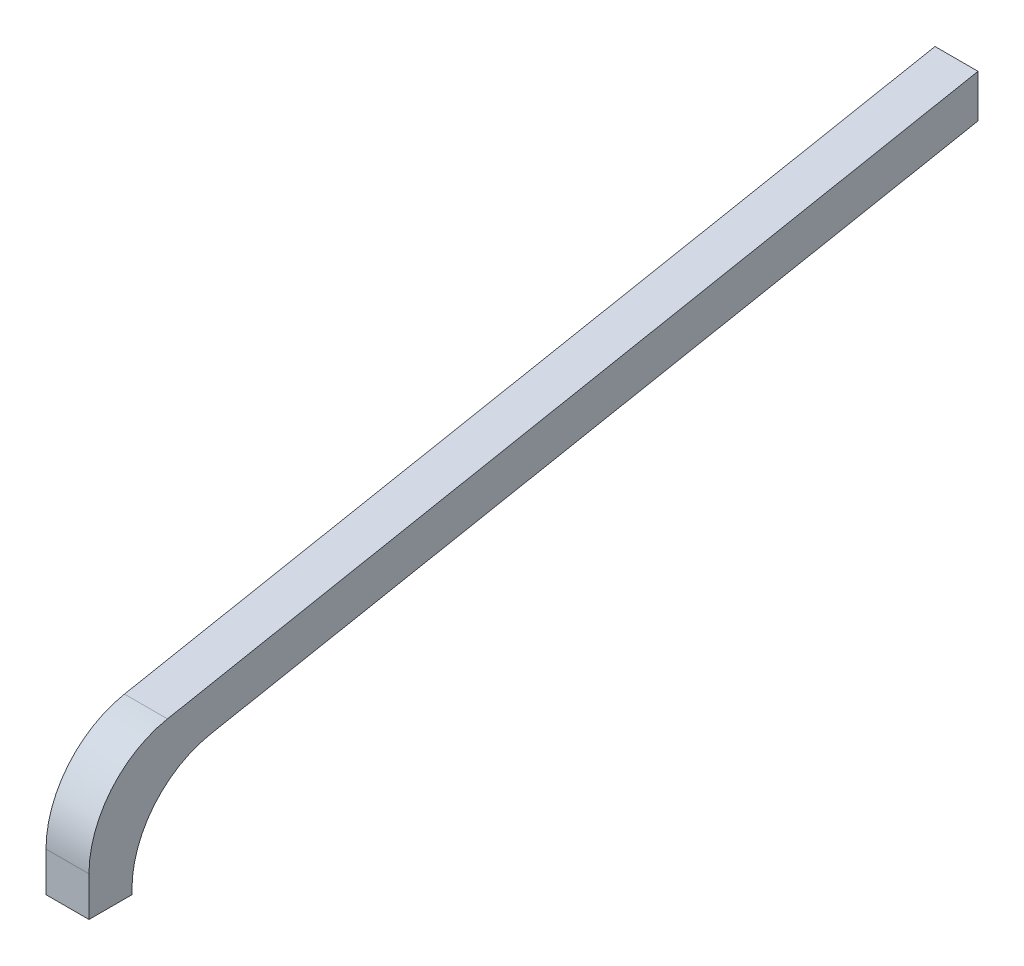
ISO-10303-21;
HEADER;
FILE_DESCRIPTION(('STEP AP214'),'2;1');
FILE_NAME('part.step','',(''),(''),'','','');
FILE_SCHEMA(('AUTOMOTIVE_DESIGN { 1 0 10303 214 1 1 1 1 }'));
ENDSEC;
DATA;
#1=APPLICATION_CONTEXT('core data for automotive mechanical design processes');
#2=APPLICATION_PROTOCOL_DEFINITION('international standard','automotive_design',2000,#1);
#3=PRODUCT_CONTEXT('',#1,'mechanical');
#4=PRODUCT('Part','Part','',(#3));
#5=PRODUCT_RELATED_PRODUCT_CATEGORY('part','',(#4));
#6=PRODUCT_DEFINITION_FORMATION('','',#4);
#7=PRODUCT_DEFINITION_CONTEXT('part definition',#1,'design');
#8=PRODUCT_DEFINITION('design','',#6,#7);
#9=PRODUCT_DEFINITION_SHAPE('','',#8);
#10=(LENGTH_UNIT() NAMED_UNIT(*) SI_UNIT(.MILLI.,.METRE.));
#11=(NAMED_UNIT(*) PLANE_ANGLE_UNIT() SI_UNIT($,.RADIAN.));
#12=(NAMED_UNIT(*) SI_UNIT($,.STERADIAN.) SOLID_ANGLE_UNIT());
#13=UNCERTAINTY_MEASURE_WITH_UNIT(LENGTH_MEASURE(1.E-05),#10,'distance_accuracy_value','');
#14=(GEOMETRIC_REPRESENTATION_CONTEXT(3) GLOBAL_UNCERTAINTY_ASSIGNED_CONTEXT((#13)) GLOBAL_UNIT_ASSIGNED_CONTEXT((#10,
#11,#12)) REPRESENTATION_CONTEXT('',''));
#15=CARTESIAN_POINT('',(0.,0.,0.));
#16=DIRECTION('',(0.,0.,1.));
#17=DIRECTION('',(1.,0.,0.));
#18=AXIS2_PLACEMENT_3D('',#15,#16,#17);
#19=CARTESIAN_POINT('',(-0.73025,-3.01580115473571,-2.8055));
#20=DIRECTION('',(1.,0.,0.));
#21=DIRECTION('',(0.,0.,-1.));
#22=AXIS2_PLACEMENT_3D('',#19,#20,#21);
#23=PLANE('',#22);
#24=DIRECTION('',(0.,-0.18846469104419,0.982079966311104));
#25=VECTOR('',#24,1.);
#26=CARTESIAN_POINT('',(-0.73025,-2.3929200336889,-3.06153530895581));
#27=LINE('',#26,#25);
#28=CARTESIAN_POINT('',(-0.73025,-0.869500000000001,-11.));
#29=VERTEX_POINT('',#28);
#30=CARTESIAN_POINT('',(-0.73025,-2.3929200336889,-3.06153530895581));
#31=VERTEX_POINT('',#30);
#32=EDGE_CURVE('E96',#29,#31,#27,.T.);
#33=ORIENTED_EDGE('',*,*,#32,.T.);
#34=CARTESIAN_POINT('',(-0.73025,-3.375,-3.25));
#35=DIRECTION('',(-1.,0.,0.));
#36=DIRECTION('',(0.,0.,1.));
#37=AXIS2_PLACEMENT_3D('',#34,#35,#36);
#38=CIRCLE('',#37,1.);
#39=CARTESIAN_POINT('',(-0.73025,-3.375,-2.25));
#40=VERTEX_POINT('',#39);
#41=EDGE_CURVE('E119',#31,#40,#38,.F.);
#42=ORIENTED_EDGE('',*,*,#41,.T.);
#43=DIRECTION('',(0.,1.,0.));
#44=VECTOR('',#43,1.);
#45=CARTESIAN_POINT('',(-0.73025,-3.425,-2.25));
#46=LINE('',#45,#44);
#47=CARTESIAN_POINT('',(-0.73025,-3.425,-2.25));
#48=VERTEX_POINT('',#47);
#49=EDGE_CURVE('E124',#40,#48,#46,.F.);
#50=ORIENTED_EDGE('',*,*,#49,.T.);
#51=DIRECTION('',(0.,0.,1.));
#52=VECTOR('',#51,1.);
#53=CARTESIAN_POINT('',(-0.73025,-3.425,-1.8055));
#54=LINE('',#53,#52);
#55=CARTESIAN_POINT('',(-0.73025,-3.425,-1.8055));
#56=VERTEX_POINT('',#55);
#57=EDGE_CURVE('E133',#48,#56,#54,.T.);
#58=ORIENTED_EDGE('',*,*,#57,.T.);
#59=DIRECTION('',(0.,1.,0.));
#60=VECTOR('',#59,1.);
#61=CARTESIAN_POINT('',(-0.73025,-3.01580115473571,-1.8055));
#62=LINE('',#61,#60);
#63=CARTESIAN_POINT('',(-0.73025,-3.01580115473571,-1.8055));
#64=VERTEX_POINT('',#63);
#65=EDGE_CURVE('E141',#56,#64,#62,.T.);
#66=ORIENTED_EDGE('',*,*,#65,.T.);
#67=CARTESIAN_POINT('',(-0.73025,-3.01580115473571,-2.8055));
#68=DIRECTION('',(-1.,0.,0.));
#69=DIRECTION('',(0.,0.,1.));
#70=AXIS2_PLACEMENT_3D('',#67,#68,#69);
#71=CIRCLE('',#70,1.);
#72=CARTESIAN_POINT('',(-0.73025,-2.03372118842461,-2.61703530895581));
#73=VERTEX_POINT('',#72);
#74=EDGE_CURVE('E20',#73,#64,#71,.F.);
#75=ORIENTED_EDGE('',*,*,#74,.F.);
#76=DIRECTION('',(0.,0.18846469104419,-0.982079966311104));
#77=VECTOR('',#76,1.);
#78=CARTESIAN_POINT('',(-0.73025,-0.425000000000001,-11.));
#79=LINE('',#78,#77);
#80=CARTESIAN_POINT('',(-0.73025,-0.425000000000001,-11.));
#81=VERTEX_POINT('',#80);
#82=EDGE_CURVE('E150',#73,#81,#79,.T.);
#83=ORIENTED_EDGE('',*,*,#82,.T.);
#84=DIRECTION('',(0.,1.,0.));
#85=VECTOR('',#84,1.);
#86=CARTESIAN_POINT('',(-0.73025,-0.869500000000001,-11.));
#87=LINE('',#86,#85);
#88=EDGE_CURVE('E70',#81,#29,#87,.F.);
#89=ORIENTED_EDGE('',*,*,#88,.T.);
#90=EDGE_LOOP('',(#33,#42,#50,#58,#66,#75,#83,#89));
#91=FACE_BOUND('',#90,.T.);
#92=ADVANCED_FACE('F17',(#91),#23,.F.);
#93=CARTESIAN_POINT('',(-0.28575,-0.869500000000001,-11.));
#94=DIRECTION('',(0.,0.,1.));
#95=DIRECTION('',(1.,0.,0.));
#96=AXIS2_PLACEMENT_3D('',#93,#94,#95);
#97=PLANE('',#96);
#98=DIRECTION('',(1.,0.,0.));
#99=VECTOR('',#98,1.);
#100=CARTESIAN_POINT('',(-0.28575,-0.425000000000001,-11.));
#101=LINE('',#100,#99);
#102=CARTESIAN_POINT('',(-0.28575,-0.425000000000001,-11.));
#103=VERTEX_POINT('',#102);
#104=EDGE_CURVE('E91',#81,#103,#101,.T.);
#105=ORIENTED_EDGE('',*,*,#104,.T.);
#106=DIRECTION('',(0.,1.,0.));
#107=VECTOR('',#106,1.);
#108=CARTESIAN_POINT('',(-0.28575,-3.01580115473571,-11.));
#109=LINE('',#108,#107);
#110=CARTESIAN_POINT('',(-0.28575,-0.869500000000001,-11.));
#111=VERTEX_POINT('',#110);
#112=EDGE_CURVE('E85',#111,#103,#109,.T.);
#113=ORIENTED_EDGE('',*,*,#112,.F.);
#114=DIRECTION('',(1.,0.,0.));
#115=VECTOR('',#114,1.);
#116=CARTESIAN_POINT('',(-0.28575,-0.869500000000001,-11.));
#117=LINE('',#116,#115);
#118=EDGE_CURVE('E88',#111,#29,#117,.F.);
#119=ORIENTED_EDGE('',*,*,#118,.T.);
#120=ORIENTED_EDGE('',*,*,#88,.F.);
#121=EDGE_LOOP('',(#105,#113,#119,#120));
#122=FACE_BOUND('',#121,.T.);
#123=ADVANCED_FACE('F87',(#122),#97,.F.);
#124=CARTESIAN_POINT('',(-0.28575,-0.425000000000001,-11.));
#125=DIRECTION('',(0.,-0.982079966311104,-0.18846469104419));
#126=DIRECTION('',(0.,0.18846469104419,-0.982079966311104));
#127=AXIS2_PLACEMENT_3D('',#124,#125,#126);
#128=PLANE('',#127);
#129=DIRECTION('',(-1.,0.,0.));
#130=VECTOR('',#129,1.);
#131=CARTESIAN_POINT('',(-0.28575,-2.03372118842461,-2.61703530895581));
#132=LINE('',#131,#130);
#133=CARTESIAN_POINT('',(-0.28575,-2.03372118842461,-2.61703530895581));
#134=VERTEX_POINT('',#133);
#135=EDGE_CURVE('E146',#134,#73,#132,.T.);
#136=ORIENTED_EDGE('',*,*,#135,.F.);
#137=DIRECTION('',(0.,-0.18846469104419,0.982079966311103));
#138=VECTOR('',#137,1.);
#139=CARTESIAN_POINT('',(-0.28575,-0.425000000000001,-11.));
#140=LINE('',#139,#138);
#141=EDGE_CURVE('E95',#103,#134,#140,.T.);
#142=ORIENTED_EDGE('',*,*,#141,.F.);
#143=ORIENTED_EDGE('',*,*,#104,.F.);
#144=ORIENTED_EDGE('',*,*,#82,.F.);
#145=EDGE_LOOP('',(#136,#142,#143,#144));
#146=FACE_BOUND('',#145,.T.);
#147=ADVANCED_FACE('F190',(#146),#128,.F.);
#148=CARTESIAN_POINT('',(-0.28575,-3.01580115473571,-2.8055));
#149=DIRECTION('',(-1.,0.,0.));
#150=DIRECTION('',(0.,0.,1.));
#151=AXIS2_PLACEMENT_3D('',#148,#149,#150);
#152=CYLINDRICAL_SURFACE('',#151,1.);
#153=CARTESIAN_POINT('',(-0.28575,-3.01580115473571,-2.8055));
#154=DIRECTION('',(-1.,0.,0.));
#155=DIRECTION('',(0.,0.,1.));
#156=AXIS2_PLACEMENT_3D('',#153,#154,#155);
#157=CIRCLE('',#156,1.);
#158=CARTESIAN_POINT('',(-0.28575,-3.01580115473571,-1.8055));
#159=VERTEX_POINT('',#158);
#160=EDGE_CURVE('E116',#134,#159,#157,.F.);
#161=ORIENTED_EDGE('',*,*,#160,.F.);
#162=ORIENTED_EDGE('',*,*,#135,.T.);
#163=ORIENTED_EDGE('',*,*,#74,.T.);
#164=DIRECTION('',(-1.,0.,0.));
#165=VECTOR('',#164,1.);
#166=CARTESIAN_POINT('',(-0.28575,-3.01580115473571,-1.8055));
#167=LINE('',#166,#165);
#168=EDGE_CURVE('E144',#64,#159,#167,.F.);
#169=ORIENTED_EDGE('',*,*,#168,.T.);
#170=EDGE_LOOP('',(#161,#162,#163,#169));
#171=FACE_BOUND('',#170,.T.);
#172=ADVANCED_FACE('F169',(#171),#152,.T.);
#173=CARTESIAN_POINT('',(-0.28575,-3.01580115473571,-1.8055));
#174=DIRECTION('',(0.,0.,-1.));
#175=DIRECTION('',(-1.,0.,0.));
#176=AXIS2_PLACEMENT_3D('',#173,#174,#175);
#177=PLANE('',#176);
#178=DIRECTION('',(1.,0.,0.));
#179=VECTOR('',#178,1.);
#180=CARTESIAN_POINT('',(-0.28575,-3.425,-1.8055));
#181=LINE('',#180,#179);
#182=CARTESIAN_POINT('',(-0.28575,-3.425,-1.8055));
#183=VERTEX_POINT('',#182);
#184=EDGE_CURVE('E139',#56,#183,#181,.T.);
#185=ORIENTED_EDGE('',*,*,#184,.T.);
#186=DIRECTION('',(0.,1.,0.));
#187=VECTOR('',#186,1.);
#188=CARTESIAN_POINT('',(-0.28575,-3.01580115473571,-1.8055));
#189=LINE('',#188,#187);
#190=EDGE_CURVE('E118',#159,#183,#189,.F.);
#191=ORIENTED_EDGE('',*,*,#190,.F.);
#192=ORIENTED_EDGE('',*,*,#168,.F.);
#193=ORIENTED_EDGE('',*,*,#65,.F.);
#194=EDGE_LOOP('',(#185,#191,#192,#193));
#195=FACE_BOUND('',#194,.T.);
#196=ADVANCED_FACE('F174',(#195),#177,.F.);
#197=CARTESIAN_POINT('',(-0.28575,-3.425,-1.8055));
#198=DIRECTION('',(0.,1.,0.));
#199=DIRECTION('',(0.,0.,1.));
#200=AXIS2_PLACEMENT_3D('',#197,#198,#199);
#201=PLANE('',#200);
#202=DIRECTION('',(1.,0.,0.));
#203=VECTOR('',#202,1.);
#204=CARTESIAN_POINT('',(-0.28575,-3.425,-2.25));
#205=LINE('',#204,#203);
#206=CARTESIAN_POINT('',(-0.28575,-3.425,-2.25));
#207=VERTEX_POINT('',#206);
#208=EDGE_CURVE('E127',#48,#207,#205,.T.);
#209=ORIENTED_EDGE('',*,*,#208,.T.);
#210=DIRECTION('',(0.,0.,-1.));
#211=VECTOR('',#210,1.);
#212=CARTESIAN_POINT('',(-0.28575,-3.425,-2.8055));
#213=LINE('',#212,#211);
#214=EDGE_CURVE('E110',#183,#207,#213,.T.);
#215=ORIENTED_EDGE('',*,*,#214,.F.);
#216=ORIENTED_EDGE('',*,*,#184,.F.);
#217=ORIENTED_EDGE('',*,*,#57,.F.);
#218=EDGE_LOOP('',(#209,#215,#216,#217));
#219=FACE_BOUND('',#218,.T.);
#220=ADVANCED_FACE('F212',(#219),#201,.F.);
#221=CARTESIAN_POINT('',(-0.28575,-3.425,-2.25));
#222=DIRECTION('',(0.,0.,1.));
#223=DIRECTION('',(1.,0.,0.));
#224=AXIS2_PLACEMENT_3D('',#221,#222,#223);
#225=PLANE('',#224);
#226=DIRECTION('',(-1.,0.,0.));
#227=VECTOR('',#226,1.);
#228=CARTESIAN_POINT('',(-0.28575,-3.375,-2.25));
#229=LINE('',#228,#227);
#230=CARTESIAN_POINT('',(-0.28575,-3.375,-2.25));
#231=VERTEX_POINT('',#230);
#232=EDGE_CURVE('E121',#40,#231,#229,.F.);
#233=ORIENTED_EDGE('',*,*,#232,.T.);
#234=DIRECTION('',(0.,1.,0.));
#235=VECTOR('',#234,1.);
#236=CARTESIAN_POINT('',(-0.28575,-3.01580115473571,-2.25));
#237=LINE('',#236,#235);
#238=EDGE_CURVE('E107',#207,#231,#237,.T.);
#239=ORIENTED_EDGE('',*,*,#238,.F.);
#240=ORIENTED_EDGE('',*,*,#208,.F.);
#241=ORIENTED_EDGE('',*,*,#49,.F.);
#242=EDGE_LOOP('',(#233,#239,#240,#241));
#243=FACE_BOUND('',#242,.T.);
#244=ADVANCED_FACE('F209',(#243),#225,.F.);
#245=CARTESIAN_POINT('',(-0.28575,-3.375,-3.25));
#246=DIRECTION('',(-1.,0.,0.));
#247=DIRECTION('',(0.,0.,1.));
#248=AXIS2_PLACEMENT_3D('',#245,#246,#247);
#249=CYLINDRICAL_SURFACE('',#248,1.);
#250=DIRECTION('',(1.,0.,0.));
#251=VECTOR('',#250,1.);
#252=CARTESIAN_POINT('',(-0.28575,-2.3929200336889,-3.06153530895581));
#253=LINE('',#252,#251);
#254=CARTESIAN_POINT('',(-0.28575,-2.3929200336889,-3.06153530895581));
#255=VERTEX_POINT('',#254);
#256=EDGE_CURVE('E35',#31,#255,#253,.T.);
#257=ORIENTED_EDGE('',*,*,#256,.T.);
#258=CARTESIAN_POINT('',(-0.28575,-3.375,-3.25));
#259=DIRECTION('',(-1.,0.,0.));
#260=DIRECTION('',(0.,0.,1.));
#261=AXIS2_PLACEMENT_3D('',#258,#259,#260);
#262=CIRCLE('',#261,1.);
#263=EDGE_CURVE('E26',#231,#255,#262,.T.);
#264=ORIENTED_EDGE('',*,*,#263,.F.);
#265=ORIENTED_EDGE('',*,*,#232,.F.);
#266=ORIENTED_EDGE('',*,*,#41,.F.);
#267=EDGE_LOOP('',(#257,#264,#265,#266));
#268=FACE_BOUND('',#267,.T.);
#269=ADVANCED_FACE('F204',(#268),#249,.F.);
#270=CARTESIAN_POINT('',(-0.28575,-2.3929200336889,-3.06153530895581));
#271=DIRECTION('',(0.,0.982079966311104,0.18846469104419));
#272=DIRECTION('',(0.,-0.18846469104419,0.982079966311104));
#273=AXIS2_PLACEMENT_3D('',#270,#271,#272);
#274=PLANE('',#273);
#275=ORIENTED_EDGE('',*,*,#118,.F.);
#276=DIRECTION('',(0.,0.18846469104419,-0.982079966311103));
#277=VECTOR('',#276,1.);
#278=CARTESIAN_POINT('',(-0.28575,-2.3929200336889,-3.06153530895581));
#279=LINE('',#278,#277);
#280=EDGE_CURVE('E11',#255,#111,#279,.T.);
#281=ORIENTED_EDGE('',*,*,#280,.F.);
#282=ORIENTED_EDGE('',*,*,#256,.F.);
#283=ORIENTED_EDGE('',*,*,#32,.F.);
#284=EDGE_LOOP('',(#275,#281,#282,#283));
#285=FACE_BOUND('',#284,.T.);
#286=ADVANCED_FACE('F99',(#285),#274,.F.);
#287=CARTESIAN_POINT('',(-0.28575,-3.01580115473571,-2.8055));
#288=DIRECTION('',(1.,0.,0.));
#289=DIRECTION('',(0.,0.,-1.));
#290=AXIS2_PLACEMENT_3D('',#287,#288,#289);
#291=PLANE('',#290);
#292=ORIENTED_EDGE('',*,*,#263,.T.);
#293=ORIENTED_EDGE('',*,*,#280,.T.);
#294=ORIENTED_EDGE('',*,*,#112,.T.);
#295=ORIENTED_EDGE('',*,*,#141,.T.);
#296=ORIENTED_EDGE('',*,*,#160,.T.);
#297=ORIENTED_EDGE('',*,*,#190,.T.);
#298=ORIENTED_EDGE('',*,*,#214,.T.);
#299=ORIENTED_EDGE('',*,*,#238,.T.);
#300=EDGE_LOOP('',(#292,#293,#294,#295,#296,#297,#298,#299));
#301=FACE_BOUND('',#300,.T.);
#302=ADVANCED_FACE('F103',(#301),#291,.T.);
#303=CLOSED_SHELL('',(#92,#123,#147,#172,#196,#220,#244,#269,#286,#302));
#304=MANIFOLD_SOLID_BREP('B1',#303);
#305=ADVANCED_BREP_SHAPE_REPRESENTATION('',(#18,#304),#14);
#306=SHAPE_DEFINITION_REPRESENTATION(#9,#305);
ENDSEC;
END-ISO-10303-21;
